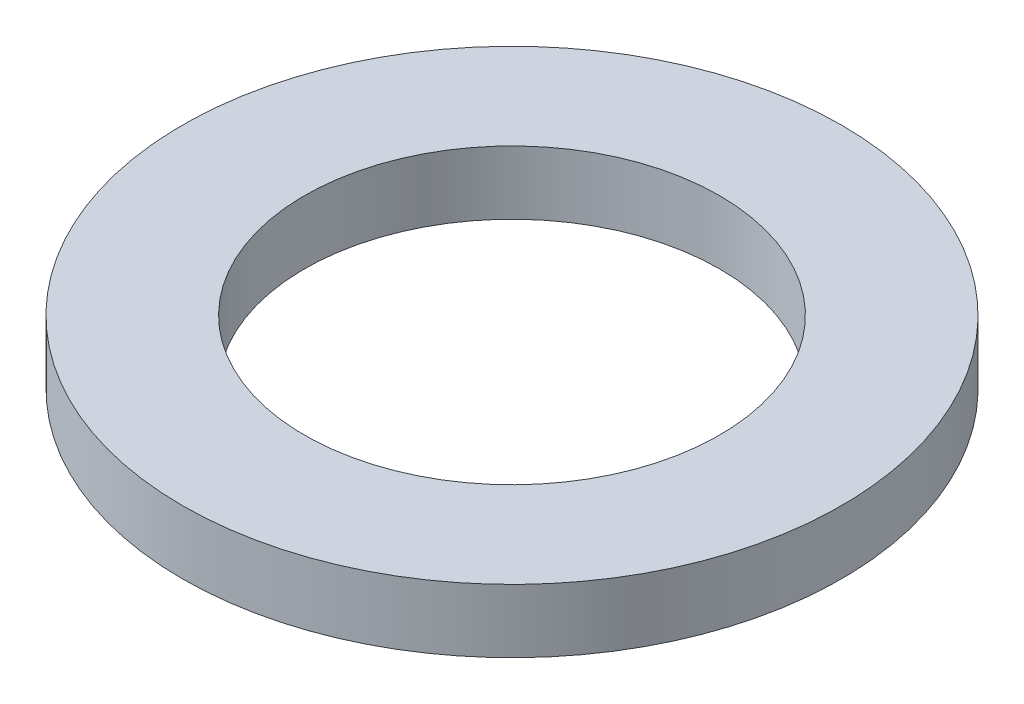
ISO-10303-21;
HEADER;
FILE_DESCRIPTION(('STEP AP214'),'2;1');
FILE_NAME('part.step','',(''),(''),'','','');
FILE_SCHEMA(('AUTOMOTIVE_DESIGN { 1 0 10303 214 1 1 1 1 }'));
ENDSEC;
DATA;
#1=APPLICATION_CONTEXT('core data for automotive mechanical design processes');
#2=APPLICATION_PROTOCOL_DEFINITION('international standard','automotive_design',2000,#1);
#3=PRODUCT_CONTEXT('',#1,'mechanical');
#4=PRODUCT('Part','Part','',(#3));
#5=PRODUCT_RELATED_PRODUCT_CATEGORY('part','',(#4));
#6=PRODUCT_DEFINITION_FORMATION('','',#4);
#7=PRODUCT_DEFINITION_CONTEXT('part definition',#1,'design');
#8=PRODUCT_DEFINITION('design','',#6,#7);
#9=PRODUCT_DEFINITION_SHAPE('','',#8);
#10=(LENGTH_UNIT() NAMED_UNIT(*) SI_UNIT(.MILLI.,.METRE.));
#11=(NAMED_UNIT(*) PLANE_ANGLE_UNIT() SI_UNIT($,.RADIAN.));
#12=(NAMED_UNIT(*) SI_UNIT($,.STERADIAN.) SOLID_ANGLE_UNIT());
#13=UNCERTAINTY_MEASURE_WITH_UNIT(LENGTH_MEASURE(1.E-05),#10,'distance_accuracy_value','');
#14=(GEOMETRIC_REPRESENTATION_CONTEXT(3) GLOBAL_UNCERTAINTY_ASSIGNED_CONTEXT((#13)) GLOBAL_UNIT_ASSIGNED_CONTEXT((#10,
#11,#12)) REPRESENTATION_CONTEXT('',''));
#15=CARTESIAN_POINT('',(0.,0.,0.));
#16=DIRECTION('',(0.,0.,1.));
#17=DIRECTION('',(1.,0.,0.));
#18=AXIS2_PLACEMENT_3D('',#15,#16,#17);
#19=CARTESIAN_POINT('',(0.,13.,0.));
#20=DIRECTION('',(0.,-1.,0.));
#21=DIRECTION('',(0.,0.,-1.));
#22=AXIS2_PLACEMENT_3D('',#19,#20,#21);
#23=CYLINDRICAL_SURFACE('',#22,67.5);
#24=CARTESIAN_POINT('',(0.,13.,0.));
#25=DIRECTION('',(0.,1.,0.));
#26=DIRECTION('',(0.,0.,1.));
#27=AXIS2_PLACEMENT_3D('',#24,#25,#26);
#28=CIRCLE('',#27,67.5);
#29=CARTESIAN_POINT('',(0.,13.,-67.5));
#30=VERTEX_POINT('',#29);
#31=EDGE_CURVE('E10',#30,#30,#28,.T.);
#32=CARTESIAN_POINT('',(0.,0.,0.));
#33=DIRECTION('',(0.,1.,0.));
#34=DIRECTION('',(0.,0.,1.));
#35=AXIS2_PLACEMENT_3D('',#32,#33,#34);
#36=CIRCLE('',#35,67.5);
#37=CARTESIAN_POINT('',(0.,0.,-67.5));
#38=VERTEX_POINT('',#37);
#39=EDGE_CURVE('E37',#38,#38,#36,.T.);
#40=CARTESIAN_POINT('',(0.,13.,-67.5));
#41=CARTESIAN_POINT('',(0.,12.8645833333333,-67.5));
#42=CARTESIAN_POINT('',(0.,12.7291666666667,-67.5));
#43=CARTESIAN_POINT('',(0.,12.4583333333333,-67.5));
#44=CARTESIAN_POINT('',(0.,12.3229166666667,-67.5));
#45=CARTESIAN_POINT('',(0.,12.0520833333333,-67.5));
#46=CARTESIAN_POINT('',(0.,11.9166666666667,-67.5));
#47=CARTESIAN_POINT('',(0.,11.6458333333333,-67.5));
#48=CARTESIAN_POINT('',(0.,11.5104166666667,-67.5));
#49=CARTESIAN_POINT('',(0.,11.2395833333333,-67.5));
#50=CARTESIAN_POINT('',(0.,11.1041666666667,-67.5));
#51=CARTESIAN_POINT('',(0.,10.8333333333333,-67.5));
#52=CARTESIAN_POINT('',(0.,10.6979166666667,-67.5));
#53=CARTESIAN_POINT('',(0.,10.4270833333333,-67.5));
#54=CARTESIAN_POINT('',(0.,10.2916666666667,-67.5));
#55=CARTESIAN_POINT('',(0.,10.0208333333333,-67.5));
#56=CARTESIAN_POINT('',(0.,9.88541666666667,-67.5));
#57=CARTESIAN_POINT('',(0.,9.61458333333333,-67.5));
#58=CARTESIAN_POINT('',(0.,9.47916666666667,-67.5));
#59=CARTESIAN_POINT('',(0.,9.20833333333333,-67.5));
#60=CARTESIAN_POINT('',(0.,9.07291666666667,-67.5));
#61=CARTESIAN_POINT('',(0.,8.80208333333333,-67.5));
#62=CARTESIAN_POINT('',(0.,8.66666666666667,-67.5));
#63=CARTESIAN_POINT('',(0.,8.39583333333333,-67.5));
#64=CARTESIAN_POINT('',(0.,8.26041666666667,-67.5));
#65=CARTESIAN_POINT('',(0.,7.98958333333333,-67.5));
#66=CARTESIAN_POINT('',(0.,7.85416666666667,-67.5));
#67=CARTESIAN_POINT('',(0.,7.58333333333333,-67.5));
#68=CARTESIAN_POINT('',(0.,7.44791666666667,-67.5));
#69=CARTESIAN_POINT('',(0.,7.17708333333333,-67.5));
#70=CARTESIAN_POINT('',(0.,7.04166666666667,-67.5));
#71=CARTESIAN_POINT('',(0.,6.77083333333333,-67.5));
#72=CARTESIAN_POINT('',(0.,6.63541666666667,-67.5));
#73=CARTESIAN_POINT('',(0.,6.36458333333333,-67.5));
#74=CARTESIAN_POINT('',(0.,6.22916666666667,-67.5));
#75=CARTESIAN_POINT('',(0.,5.95833333333333,-67.5));
#76=CARTESIAN_POINT('',(0.,5.82291666666667,-67.5));
#77=CARTESIAN_POINT('',(0.,5.55208333333333,-67.5));
#78=CARTESIAN_POINT('',(0.,5.41666666666667,-67.5));
#79=CARTESIAN_POINT('',(0.,5.14583333333333,-67.5));
#80=CARTESIAN_POINT('',(0.,5.01041666666667,-67.5));
#81=CARTESIAN_POINT('',(0.,4.73958333333333,-67.5));
#82=CARTESIAN_POINT('',(0.,4.60416666666667,-67.5));
#83=CARTESIAN_POINT('',(0.,4.33333333333333,-67.5));
#84=CARTESIAN_POINT('',(0.,4.19791666666667,-67.5));
#85=CARTESIAN_POINT('',(0.,3.92708333333333,-67.5));
#86=CARTESIAN_POINT('',(0.,3.79166666666667,-67.5));
#87=CARTESIAN_POINT('',(0.,3.52083333333333,-67.5));
#88=CARTESIAN_POINT('',(0.,3.38541666666667,-67.5));
#89=CARTESIAN_POINT('',(0.,3.11458333333333,-67.5));
#90=CARTESIAN_POINT('',(0.,2.97916666666667,-67.5));
#91=CARTESIAN_POINT('',(0.,2.70833333333333,-67.5));
#92=CARTESIAN_POINT('',(0.,2.57291666666667,-67.5));
#93=CARTESIAN_POINT('',(0.,2.30208333333333,-67.5));
#94=CARTESIAN_POINT('',(0.,2.16666666666667,-67.5));
#95=CARTESIAN_POINT('',(0.,1.89583333333333,-67.5));
#96=CARTESIAN_POINT('',(0.,1.76041666666667,-67.5));
#97=CARTESIAN_POINT('',(0.,1.48958333333333,-67.5));
#98=CARTESIAN_POINT('',(0.,1.35416666666667,-67.5));
#99=CARTESIAN_POINT('',(0.,1.08333333333333,-67.5));
#100=CARTESIAN_POINT('',(0.,0.947916666666667,-67.5));
#101=CARTESIAN_POINT('',(0.,0.677083333333334,-67.5));
#102=CARTESIAN_POINT('',(0.,0.541666666666667,-67.5));
#103=CARTESIAN_POINT('',(0.,0.270833333333334,-67.5));
#104=CARTESIAN_POINT('',(0.,0.135416666666667,-67.5));
#105=CARTESIAN_POINT('',(0.,0.,-67.5));
#106=B_SPLINE_CURVE_WITH_KNOTS('',3,(#40,#41,#42,#43,#44,#45,#46,#47,#48,#49,#50,#51,#52,#53,
#54,#55,#56,#57,#58,#59,#60,#61,#62,#63,#64,#65,#66,#67,#68,#69,#70,#71,#72,#73,#74,#75,#76,#77,
#78,#79,#80,#81,#82,#83,#84,#85,#86,#87,#88,#89,#90,#91,#92,#93,#94,#95,#96,#97,#98,#99,#100,
#101,#102,#103,#104,#105),.UNSPECIFIED.,.F.,.F.,(4,2,2,2,2,2,2,2,2,2,2,2,2,2,2,2,2,2,2,2,2,2,2,
2,2,2,2,2,2,2,2,2,4),(0.,0.406249999999999,0.812499999999999,1.21875,1.625,2.03125,2.4375,
2.84375,3.25,3.65625,4.0625,4.46875,4.875,5.28125,5.6875,6.09375,6.5,6.90625,7.3125,7.71875,
8.125,8.53125,8.9375,9.34375,9.75,10.15625,10.5625,10.96875,11.375,11.78125,12.1875,12.59375,
13.),.UNSPECIFIED.);
#107=EDGE_CURVE('BSEAM40',#30,#38,#106,.T.);
#108=ORIENTED_EDGE('',*,*,#31,.F.);
#109=ORIENTED_EDGE('',*,*,#39,.T.);
#110=ORIENTED_EDGE('',*,*,#107,.T.);
#111=ORIENTED_EDGE('',*,*,#107,.F.);
#112=EDGE_LOOP('',(#108,#110,#109,#111));
#113=FACE_BOUND('',#112,.T.);
#114=ADVANCED_FACE('F40',(#113),#23,.T.);
#115=CARTESIAN_POINT('',(0.,13.,0.));
#116=DIRECTION('',(0.,1.,0.));
#117=DIRECTION('',(0.,0.,1.));
#118=AXIS2_PLACEMENT_3D('',#115,#116,#117);
#119=PLANE('',#118);
#120=CARTESIAN_POINT('',(0.,13.,0.));
#121=DIRECTION('',(0.,1.,0.));
#122=DIRECTION('',(0.,0.,1.));
#123=AXIS2_PLACEMENT_3D('',#120,#121,#122);
#124=CIRCLE('',#123,42.5);
#125=CARTESIAN_POINT('',(0.,13.,-42.5));
#126=VERTEX_POINT('',#125);
#127=EDGE_CURVE('E50',#126,#126,#124,.T.);
#128=ORIENTED_EDGE('',*,*,#127,.F.);
#129=EDGE_LOOP('',(#128));
#130=FACE_BOUND('',#129,.T.);
#131=ORIENTED_EDGE('',*,*,#31,.T.);
#132=EDGE_LOOP('',(#131));
#133=FACE_BOUND('',#132,.T.);
#134=ADVANCED_FACE('F59',(#130,#133),#119,.T.);
#135=CARTESIAN_POINT('',(0.,0.,0.));
#136=DIRECTION('',(0.,1.,0.));
#137=DIRECTION('',(0.,0.,1.));
#138=AXIS2_PLACEMENT_3D('',#135,#136,#137);
#139=PLANE('',#138);
#140=CARTESIAN_POINT('',(0.,0.,0.));
#141=DIRECTION('',(0.,1.,0.));
#142=DIRECTION('',(0.,0.,1.));
#143=AXIS2_PLACEMENT_3D('',#140,#141,#142);
#144=CIRCLE('',#143,42.5);
#145=CARTESIAN_POINT('',(0.,0.,-42.5));
#146=VERTEX_POINT('',#145);
#147=EDGE_CURVE('E47',#146,#146,#144,.T.);
#148=ORIENTED_EDGE('',*,*,#147,.T.);
#149=EDGE_LOOP('',(#148));
#150=FACE_BOUND('',#149,.T.);
#151=ORIENTED_EDGE('',*,*,#39,.F.);
#152=EDGE_LOOP('',(#151));
#153=FACE_BOUND('',#152,.T.);
#154=ADVANCED_FACE('F58',(#150,#153),#139,.F.);
#155=CARTESIAN_POINT('',(0.,13.,0.));
#156=DIRECTION('',(0.,-1.,0.));
#157=DIRECTION('',(0.,0.,-1.));
#158=AXIS2_PLACEMENT_3D('',#155,#156,#157);
#159=CYLINDRICAL_SURFACE('',#158,42.5);
#160=CARTESIAN_POINT('',(0.,13.,-42.5));
#161=CARTESIAN_POINT('',(0.,12.8645833333333,-42.5));
#162=CARTESIAN_POINT('',(0.,12.7291666666667,-42.5));
#163=CARTESIAN_POINT('',(0.,12.4583333333333,-42.5));
#164=CARTESIAN_POINT('',(0.,12.3229166666667,-42.5));
#165=CARTESIAN_POINT('',(0.,12.0520833333333,-42.5));
#166=CARTESIAN_POINT('',(0.,11.9166666666667,-42.5));
#167=CARTESIAN_POINT('',(0.,11.6458333333333,-42.5));
#168=CARTESIAN_POINT('',(0.,11.5104166666667,-42.5));
#169=CARTESIAN_POINT('',(0.,11.2395833333333,-42.5));
#170=CARTESIAN_POINT('',(0.,11.1041666666667,-42.5));
#171=CARTESIAN_POINT('',(0.,10.8333333333333,-42.5));
#172=CARTESIAN_POINT('',(0.,10.6979166666667,-42.5));
#173=CARTESIAN_POINT('',(0.,10.4270833333333,-42.5));
#174=CARTESIAN_POINT('',(0.,10.2916666666667,-42.5));
#175=CARTESIAN_POINT('',(0.,10.0208333333333,-42.5));
#176=CARTESIAN_POINT('',(0.,9.88541666666667,-42.5));
#177=CARTESIAN_POINT('',(0.,9.61458333333333,-42.5));
#178=CARTESIAN_POINT('',(0.,9.47916666666667,-42.5));
#179=CARTESIAN_POINT('',(0.,9.20833333333333,-42.5));
#180=CARTESIAN_POINT('',(0.,9.07291666666666,-42.5));
#181=CARTESIAN_POINT('',(0.,8.80208333333333,-42.5));
#182=CARTESIAN_POINT('',(0.,8.66666666666667,-42.5));
#183=CARTESIAN_POINT('',(0.,8.39583333333333,-42.5));
#184=CARTESIAN_POINT('',(0.,8.26041666666667,-42.5));
#185=CARTESIAN_POINT('',(0.,7.98958333333333,-42.5));
#186=CARTESIAN_POINT('',(0.,7.85416666666667,-42.5));
#187=CARTESIAN_POINT('',(0.,7.58333333333333,-42.5));
#188=CARTESIAN_POINT('',(0.,7.44791666666667,-42.5));
#189=CARTESIAN_POINT('',(0.,7.17708333333333,-42.5));
#190=CARTESIAN_POINT('',(0.,7.04166666666667,-42.5));
#191=CARTESIAN_POINT('',(0.,6.77083333333333,-42.5));
#192=CARTESIAN_POINT('',(0.,6.63541666666667,-42.5));
#193=CARTESIAN_POINT('',(0.,6.36458333333333,-42.5));
#194=CARTESIAN_POINT('',(0.,6.22916666666667,-42.5));
#195=CARTESIAN_POINT('',(0.,5.95833333333333,-42.5));
#196=CARTESIAN_POINT('',(0.,5.82291666666667,-42.5));
#197=CARTESIAN_POINT('',(0.,5.55208333333333,-42.5));
#198=CARTESIAN_POINT('',(0.,5.41666666666667,-42.5));
#199=CARTESIAN_POINT('',(0.,5.14583333333333,-42.5));
#200=CARTESIAN_POINT('',(0.,5.01041666666667,-42.5));
#201=CARTESIAN_POINT('',(0.,4.73958333333333,-42.5));
#202=CARTESIAN_POINT('',(0.,4.60416666666667,-42.5));
#203=CARTESIAN_POINT('',(0.,4.33333333333333,-42.5));
#204=CARTESIAN_POINT('',(0.,4.19791666666667,-42.5));
#205=CARTESIAN_POINT('',(0.,3.92708333333333,-42.5));
#206=CARTESIAN_POINT('',(0.,3.79166666666667,-42.5));
#207=CARTESIAN_POINT('',(0.,3.52083333333333,-42.5));
#208=CARTESIAN_POINT('',(0.,3.38541666666667,-42.5));
#209=CARTESIAN_POINT('',(0.,3.11458333333333,-42.5));
#210=CARTESIAN_POINT('',(0.,2.97916666666667,-42.5));
#211=CARTESIAN_POINT('',(0.,2.70833333333333,-42.5));
#212=CARTESIAN_POINT('',(0.,2.57291666666667,-42.5));
#213=CARTESIAN_POINT('',(0.,2.30208333333333,-42.5));
#214=CARTESIAN_POINT('',(0.,2.16666666666667,-42.5));
#215=CARTESIAN_POINT('',(0.,1.89583333333333,-42.5));
#216=CARTESIAN_POINT('',(0.,1.76041666666667,-42.5));
#217=CARTESIAN_POINT('',(0.,1.48958333333333,-42.5));
#218=CARTESIAN_POINT('',(0.,1.35416666666667,-42.5));
#219=CARTESIAN_POINT('',(0.,1.08333333333333,-42.5));
#220=CARTESIAN_POINT('',(0.,0.947916666666667,-42.5));
#221=CARTESIAN_POINT('',(0.,0.677083333333334,-42.5));
#222=CARTESIAN_POINT('',(0.,0.541666666666667,-42.5));
#223=CARTESIAN_POINT('',(0.,0.270833333333334,-42.5));
#224=CARTESIAN_POINT('',(0.,0.135416666666667,-42.5));
#225=CARTESIAN_POINT('',(0.,0.,-42.5));
#226=B_SPLINE_CURVE_WITH_KNOTS('',3,(#160,#161,#162,#163,#164,#165,#166,#167,#168,#169,#170,
#171,#172,#173,#174,#175,#176,#177,#178,#179,#180,#181,#182,#183,#184,#185,#186,#187,#188,#189,
#190,#191,#192,#193,#194,#195,#196,#197,#198,#199,#200,#201,#202,#203,#204,#205,#206,#207,#208,
#209,#210,#211,#212,#213,#214,#215,#216,#217,#218,#219,#220,#221,#222,#223,#224,#225),
.UNSPECIFIED.,.F.,.F.,(4,2,2,2,2,2,2,2,2,2,2,2,2,2,2,2,2,2,2,2,2,2,2,2,2,2,2,2,2,2,2,2,4),(0.,
0.40625,0.812500000000001,1.21875,1.625,2.03125,2.4375,2.84375,3.25,3.65625,4.0625,4.46875,
4.875,5.28125,5.6875,6.09375,6.5,6.90625,7.3125,7.71875,8.125,8.53125,8.9375,9.34375,9.75,
10.15625,10.5625,10.96875,11.375,11.78125,12.1875,12.59375,13.),.UNSPECIFIED.);
#227=EDGE_CURVE('BSEAM54',#126,#146,#226,.T.);
#228=ORIENTED_EDGE('',*,*,#127,.T.);
#229=ORIENTED_EDGE('',*,*,#147,.F.);
#230=ORIENTED_EDGE('',*,*,#227,.T.);
#231=ORIENTED_EDGE('',*,*,#227,.F.);
#232=EDGE_LOOP('',(#228,#230,#229,#231));
#233=FACE_BOUND('',#232,.T.);
#234=ADVANCED_FACE('F54',(#233),#159,.F.);
#235=CLOSED_SHELL('',(#114,#134,#154,#234));
#236=MANIFOLD_SOLID_BREP('B2',#235);
#237=ADVANCED_BREP_SHAPE_REPRESENTATION('',(#18,#236),#14);
#238=SHAPE_DEFINITION_REPRESENTATION(#9,#237);
ENDSEC;
END-ISO-10303-21;
